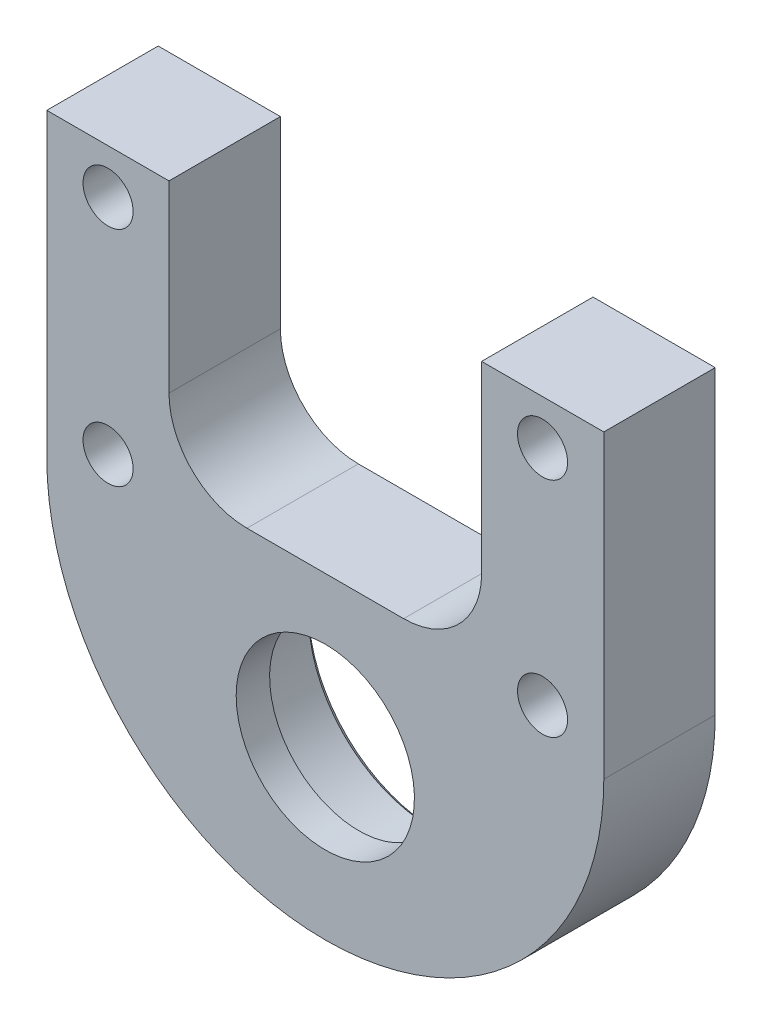
ISO-10303-21;
HEADER;
FILE_DESCRIPTION(('STEP AP214'),'2;1');
FILE_NAME('part.step','',(''),(''),'','','');
FILE_SCHEMA(('AUTOMOTIVE_DESIGN { 1 0 10303 214 1 1 1 1 }'));
ENDSEC;
DATA;
#1=APPLICATION_CONTEXT('core data for automotive mechanical design processes');
#2=APPLICATION_PROTOCOL_DEFINITION('international standard','automotive_design',2000,#1);
#3=PRODUCT_CONTEXT('',#1,'mechanical');
#4=PRODUCT('Part','Part','',(#3));
#5=PRODUCT_RELATED_PRODUCT_CATEGORY('part','',(#4));
#6=PRODUCT_DEFINITION_FORMATION('','',#4);
#7=PRODUCT_DEFINITION_CONTEXT('part definition',#1,'design');
#8=PRODUCT_DEFINITION('design','',#6,#7);
#9=PRODUCT_DEFINITION_SHAPE('','',#8);
#10=(LENGTH_UNIT() NAMED_UNIT(*) SI_UNIT(.MILLI.,.METRE.));
#11=(NAMED_UNIT(*) PLANE_ANGLE_UNIT() SI_UNIT($,.RADIAN.));
#12=(NAMED_UNIT(*) SI_UNIT($,.STERADIAN.) SOLID_ANGLE_UNIT());
#13=UNCERTAINTY_MEASURE_WITH_UNIT(LENGTH_MEASURE(1.E-05),#10,'distance_accuracy_value','');
#14=(GEOMETRIC_REPRESENTATION_CONTEXT(3) GLOBAL_UNCERTAINTY_ASSIGNED_CONTEXT((#13)) GLOBAL_UNIT_ASSIGNED_CONTEXT((#10,
#11,#12)) REPRESENTATION_CONTEXT('',''));
#15=CARTESIAN_POINT('',(0.,0.,0.));
#16=DIRECTION('',(0.,0.,1.));
#17=DIRECTION('',(1.,0.,0.));
#18=AXIS2_PLACEMENT_3D('',#15,#16,#17);
#19=CARTESIAN_POINT('',(-25.,37.,20.));
#20=DIRECTION('',(0.,-1.,0.));
#21=DIRECTION('',(1.,0.,0.));
#22=AXIS2_PLACEMENT_3D('',#19,#20,#21);
#23=PLANE('',#22);
#24=DIRECTION('',(-1.,0.,0.));
#25=VECTOR('',#24,1.);
#26=CARTESIAN_POINT('',(-25.,37.,10.));
#27=LINE('',#26,#25);
#28=CARTESIAN_POINT('',(-14.03125,37.,10.));
#29=VERTEX_POINT('',#28);
#30=CARTESIAN_POINT('',(-25.,37.,10.));
#31=VERTEX_POINT('',#30);
#32=EDGE_CURVE('E368',#29,#31,#27,.T.);
#33=ORIENTED_EDGE('',*,*,#32,.F.);
#34=DIRECTION('',(0.,0.,1.));
#35=VECTOR('',#34,1.);
#36=CARTESIAN_POINT('',(-14.03125,37.,0.));
#37=LINE('',#36,#35);
#38=CARTESIAN_POINT('',(-14.03125,37.,0.));
#39=VERTEX_POINT('',#38);
#40=EDGE_CURVE('E279',#39,#29,#37,.T.);
#41=ORIENTED_EDGE('',*,*,#40,.F.);
#42=DIRECTION('',(-1.,0.,0.));
#43=VECTOR('',#42,1.);
#44=CARTESIAN_POINT('',(-25.,37.,0.));
#45=LINE('',#44,#43);
#46=CARTESIAN_POINT('',(-25.,37.,0.));
#47=VERTEX_POINT('',#46);
#48=EDGE_CURVE('E259',#39,#47,#45,.T.);
#49=ORIENTED_EDGE('',*,*,#48,.T.);
#50=DIRECTION('',(0.,0.,-1.));
#51=VECTOR('',#50,1.);
#52=CARTESIAN_POINT('',(-25.,37.,20.));
#53=LINE('',#52,#51);
#54=EDGE_CURVE('E386',#31,#47,#53,.T.);
#55=ORIENTED_EDGE('',*,*,#54,.F.);
#56=EDGE_LOOP('',(#33,#41,#49,#55));
#57=FACE_BOUND('',#56,.T.);
#58=ADVANCED_FACE('F116',(#57),#23,.F.);
#59=CARTESIAN_POINT('',(0.,0.,0.));
#60=DIRECTION('',(0.,0.,-1.));
#61=DIRECTION('',(-1.,0.,0.));
#62=AXIS2_PLACEMENT_3D('',#59,#60,#61);
#63=PLANE('',#62);
#64=DIRECTION('',(0.,1.,0.));
#65=VECTOR('',#64,1.);
#66=CARTESIAN_POINT('',(25.,-15.,0.));
#67=LINE('',#66,#65);
#68=CARTESIAN_POINT('',(25.,10.,0.));
#69=VERTEX_POINT('',#68);
#70=CARTESIAN_POINT('',(25.,37.,0.));
#71=VERTEX_POINT('',#70);
#72=EDGE_CURVE('E381',#69,#71,#67,.T.);
#73=ORIENTED_EDGE('',*,*,#72,.F.);
#74=CARTESIAN_POINT('',(0.,10.,0.));
#75=DIRECTION('',(0.,0.,-1.));
#76=DIRECTION('',(-1.,0.,0.));
#77=AXIS2_PLACEMENT_3D('',#74,#75,#76);
#78=CIRCLE('',#77,25.);
#79=CARTESIAN_POINT('',(0.,-15.,0.));
#80=VERTEX_POINT('',#79);
#81=EDGE_CURVE('E405',#69,#80,#78,.T.);
#82=ORIENTED_EDGE('',*,*,#81,.T.);
#83=CARTESIAN_POINT('',(0.,10.,0.));
#84=DIRECTION('',(0.,0.,-1.));
#85=DIRECTION('',(-1.,0.,0.));
#86=AXIS2_PLACEMENT_3D('',#83,#84,#85);
#87=CIRCLE('',#86,25.);
#88=CARTESIAN_POINT('',(-25.,10.,0.));
#89=VERTEX_POINT('',#88);
#90=EDGE_CURVE('E403',#80,#89,#87,.T.);
#91=ORIENTED_EDGE('',*,*,#90,.T.);
#92=DIRECTION('',(0.,-1.,0.));
#93=VECTOR('',#92,1.);
#94=CARTESIAN_POINT('',(-25.,-15.,0.));
#95=LINE('',#94,#93);
#96=EDGE_CURVE('E379',#47,#89,#95,.T.);
#97=ORIENTED_EDGE('',*,*,#96,.F.);
#98=ORIENTED_EDGE('',*,*,#48,.F.);
#99=DIRECTION('',(0.,-1.,0.));
#100=VECTOR('',#99,1.);
#101=CARTESIAN_POINT('',(-14.03125,37.,0.));
#102=LINE('',#101,#100);
#103=CARTESIAN_POINT('',(-14.03125,20.5,0.));
#104=VERTEX_POINT('',#103);
#105=EDGE_CURVE('E236',#39,#104,#102,.T.);
#106=ORIENTED_EDGE('',*,*,#105,.T.);
#107=CARTESIAN_POINT('',(-7.03125000000002,20.5,0.));
#108=DIRECTION('',(0.,0.,1.));
#109=DIRECTION('',(1.,0.,0.));
#110=AXIS2_PLACEMENT_3D('',#107,#108,#109);
#111=CIRCLE('',#110,7.);
#112=CARTESIAN_POINT('',(-7.03125000000002,13.5,0.));
#113=VERTEX_POINT('',#112);
#114=EDGE_CURVE('E247',#104,#113,#111,.T.);
#115=ORIENTED_EDGE('',*,*,#114,.T.);
#116=DIRECTION('',(1.,0.,0.));
#117=VECTOR('',#116,1.);
#118=CARTESIAN_POINT('',(-7.03125000000002,13.5,0.));
#119=LINE('',#118,#117);
#120=CARTESIAN_POINT('',(7.03125000000002,13.5,0.));
#121=VERTEX_POINT('',#120);
#122=EDGE_CURVE('E252',#113,#121,#119,.T.);
#123=ORIENTED_EDGE('',*,*,#122,.T.);
#124=CARTESIAN_POINT('',(7.03125000000002,20.5,0.));
#125=DIRECTION('',(0.,0.,1.));
#126=DIRECTION('',(1.,0.,0.));
#127=AXIS2_PLACEMENT_3D('',#124,#125,#126);
#128=CIRCLE('',#127,7.);
#129=CARTESIAN_POINT('',(14.03125,20.5,0.));
#130=VERTEX_POINT('',#129);
#131=EDGE_CURVE('E266',#121,#130,#128,.T.);
#132=ORIENTED_EDGE('',*,*,#131,.T.);
#133=DIRECTION('',(0.,1.,0.));
#134=VECTOR('',#133,1.);
#135=CARTESIAN_POINT('',(14.03125,37.,0.));
#136=LINE('',#135,#134);
#137=CARTESIAN_POINT('',(14.03125,37.,0.));
#138=VERTEX_POINT('',#137);
#139=EDGE_CURVE('E244',#130,#138,#136,.T.);
#140=ORIENTED_EDGE('',*,*,#139,.T.);
#141=EDGE_CURVE('E383',#71,#138,#45,.T.);
#142=ORIENTED_EDGE('',*,*,#141,.F.);
#143=EDGE_LOOP('',(#73,#82,#91,#97,#98,#106,#115,#123,#132,#140,#142));
#144=FACE_BOUND('',#143,.T.);
#145=CARTESIAN_POINT('',(0.,0.,0.));
#146=DIRECTION('',(0.,0.,-1.));
#147=DIRECTION('',(-1.,0.,0.));
#148=AXIS2_PLACEMENT_3D('',#145,#146,#147);
#149=CIRCLE('',#148,11.5);
#150=CARTESIAN_POINT('',(-11.5,0.,0.));
#151=VERTEX_POINT('',#150);
#152=EDGE_CURVE('E397',#151,#151,#149,.F.);
#153=ORIENTED_EDGE('',*,*,#152,.T.);
#154=EDGE_LOOP('',(#153));
#155=FACE_BOUND('',#154,.T.);
#156=CARTESIAN_POINT('',(19.5,23.,0.));
#157=DIRECTION('',(0.,0.,-1.));
#158=DIRECTION('',(-1.,0.,0.));
#159=AXIS2_PLACEMENT_3D('',#156,#157,#158);
#160=CIRCLE('',#159,1.5875);
#161=CARTESIAN_POINT('',(17.9125,23.,0.));
#162=VERTEX_POINT('',#161);
#163=EDGE_CURVE('E334',#162,#162,#160,.T.);
#164=ORIENTED_EDGE('',*,*,#163,.F.);
#165=EDGE_LOOP('',(#164));
#166=FACE_BOUND('',#165,.T.);
#167=CARTESIAN_POINT('',(19.5,33.,0.));
#168=DIRECTION('',(0.,0.,1.));
#169=DIRECTION('',(1.,0.,0.));
#170=AXIS2_PLACEMENT_3D('',#167,#168,#169);
#171=CIRCLE('',#170,2.2479);
#172=CARTESIAN_POINT('',(21.7479,33.,0.));
#173=VERTEX_POINT('',#172);
#174=EDGE_CURVE('E343',#173,#173,#171,.T.);
#175=ORIENTED_EDGE('',*,*,#174,.T.);
#176=EDGE_LOOP('',(#175));
#177=FACE_BOUND('',#176,.T.);
#178=CARTESIAN_POINT('',(-19.5,33.,0.));
#179=DIRECTION('',(0.,0.,1.));
#180=DIRECTION('',(1.,0.,0.));
#181=AXIS2_PLACEMENT_3D('',#178,#179,#180);
#182=CIRCLE('',#181,2.2479);
#183=CARTESIAN_POINT('',(-17.2521,33.,0.));
#184=VERTEX_POINT('',#183);
#185=EDGE_CURVE('E349',#184,#184,#182,.T.);
#186=ORIENTED_EDGE('',*,*,#185,.T.);
#187=EDGE_LOOP('',(#186));
#188=FACE_BOUND('',#187,.T.);
#189=CARTESIAN_POINT('',(-19.5,13.,0.));
#190=DIRECTION('',(0.,0.,1.));
#191=DIRECTION('',(1.,0.,0.));
#192=AXIS2_PLACEMENT_3D('',#189,#190,#191);
#193=CIRCLE('',#192,2.2479);
#194=CARTESIAN_POINT('',(-17.2521,13.,0.));
#195=VERTEX_POINT('',#194);
#196=EDGE_CURVE('E355',#195,#195,#193,.T.);
#197=ORIENTED_EDGE('',*,*,#196,.T.);
#198=EDGE_LOOP('',(#197));
#199=FACE_BOUND('',#198,.T.);
#200=CARTESIAN_POINT('',(19.5,13.,0.));
#201=DIRECTION('',(0.,0.,1.));
#202=DIRECTION('',(1.,0.,0.));
#203=AXIS2_PLACEMENT_3D('',#200,#201,#202);
#204=CIRCLE('',#203,2.2479);
#205=CARTESIAN_POINT('',(21.7479,13.,0.));
#206=VERTEX_POINT('',#205);
#207=EDGE_CURVE('E361',#206,#206,#204,.T.);
#208=ORIENTED_EDGE('',*,*,#207,.T.);
#209=EDGE_LOOP('',(#208));
#210=FACE_BOUND('',#209,.T.);
#211=CARTESIAN_POINT('',(-19.0875,23.,0.));
#212=DIRECTION('',(0.,0.,-1.));
#213=DIRECTION('',(-1.,0.,0.));
#214=AXIS2_PLACEMENT_3D('',#211,#212,#213);
#215=CIRCLE('',#214,1.5875);
#216=CARTESIAN_POINT('',(-19.0875,24.5875,0.));
#217=VERTEX_POINT('',#216);
#218=CARTESIAN_POINT('',(-19.0875,21.4125,0.));
#219=VERTEX_POINT('',#218);
#220=EDGE_CURVE('E307',#217,#219,#215,.T.);
#221=ORIENTED_EDGE('',*,*,#220,.F.);
#222=DIRECTION('',(-1.,0.,0.));
#223=VECTOR('',#222,1.);
#224=CARTESIAN_POINT('',(-19.0875,24.5875,0.));
#225=LINE('',#224,#223);
#226=CARTESIAN_POINT('',(-19.9125,24.5875,0.));
#227=VERTEX_POINT('',#226);
#228=EDGE_CURVE('E298',#217,#227,#225,.T.);
#229=ORIENTED_EDGE('',*,*,#228,.T.);
#230=CARTESIAN_POINT('',(-19.9125,23.,0.));
#231=DIRECTION('',(0.,0.,-1.));
#232=DIRECTION('',(-1.,0.,0.));
#233=AXIS2_PLACEMENT_3D('',#230,#231,#232);
#234=CIRCLE('',#233,1.5875);
#235=CARTESIAN_POINT('',(-19.9125,21.4125,0.));
#236=VERTEX_POINT('',#235);
#237=EDGE_CURVE('E323',#236,#227,#234,.T.);
#238=ORIENTED_EDGE('',*,*,#237,.F.);
#239=DIRECTION('',(-1.,0.,0.));
#240=VECTOR('',#239,1.);
#241=CARTESIAN_POINT('',(-19.0875,21.4125,0.));
#242=LINE('',#241,#240);
#243=EDGE_CURVE('E281',#219,#236,#242,.T.);
#244=ORIENTED_EDGE('',*,*,#243,.F.);
#245=EDGE_LOOP('',(#221,#229,#238,#244));
#246=FACE_BOUND('',#245,.T.);
#247=ADVANCED_FACE('F256',(#144,#155,#166,#177,#188,#199,#210,#246),#63,.T.);
#248=CARTESIAN_POINT('',(25.,-15.,20.));
#249=DIRECTION('',(-1.,0.,0.));
#250=DIRECTION('',(0.,-1.,0.));
#251=AXIS2_PLACEMENT_3D('',#248,#249,#250);
#252=PLANE('',#251);
#253=DIRECTION('',(0.,1.,0.));
#254=VECTOR('',#253,1.);
#255=CARTESIAN_POINT('',(25.,-15.,10.));
#256=LINE('',#255,#254);
#257=CARTESIAN_POINT('',(25.,10.,10.));
#258=VERTEX_POINT('',#257);
#259=CARTESIAN_POINT('',(25.,37.,10.));
#260=VERTEX_POINT('',#259);
#261=EDGE_CURVE('E366',#258,#260,#256,.T.);
#262=ORIENTED_EDGE('',*,*,#261,.F.);
#263=DIRECTION('',(0.,0.,-1.));
#264=VECTOR('',#263,1.);
#265=CARTESIAN_POINT('',(25.,10.,20.));
#266=LINE('',#265,#264);
#267=EDGE_CURVE('E400',#258,#69,#266,.T.);
#268=ORIENTED_EDGE('',*,*,#267,.T.);
#269=ORIENTED_EDGE('',*,*,#72,.T.);
#270=DIRECTION('',(0.,0.,-1.));
#271=VECTOR('',#270,1.);
#272=CARTESIAN_POINT('',(25.,37.,20.));
#273=LINE('',#272,#271);
#274=EDGE_CURVE('E389',#260,#71,#273,.T.);
#275=ORIENTED_EDGE('',*,*,#274,.F.);
#276=EDGE_LOOP('',(#262,#268,#269,#275));
#277=FACE_BOUND('',#276,.T.);
#278=ADVANCED_FACE('F418',(#277),#252,.F.);
#279=CARTESIAN_POINT('',(-25.,-15.,20.));
#280=DIRECTION('',(1.,0.,0.));
#281=DIRECTION('',(0.,0.,-1.));
#282=AXIS2_PLACEMENT_3D('',#279,#280,#281);
#283=PLANE('',#282);
#284=ORIENTED_EDGE('',*,*,#96,.T.);
#285=DIRECTION('',(0.,0.,-1.));
#286=VECTOR('',#285,1.);
#287=CARTESIAN_POINT('',(-25.,10.,20.));
#288=LINE('',#287,#286);
#289=CARTESIAN_POINT('',(-25.,10.,10.));
#290=VERTEX_POINT('',#289);
#291=EDGE_CURVE('E14',#89,#290,#288,.F.);
#292=ORIENTED_EDGE('',*,*,#291,.T.);
#293=DIRECTION('',(0.,-1.,0.));
#294=VECTOR('',#293,1.);
#295=CARTESIAN_POINT('',(-25.,-15.,10.));
#296=LINE('',#295,#294);
#297=EDGE_CURVE('E364',#31,#290,#296,.T.);
#298=ORIENTED_EDGE('',*,*,#297,.F.);
#299=ORIENTED_EDGE('',*,*,#54,.T.);
#300=EDGE_LOOP('',(#284,#292,#298,#299));
#301=FACE_BOUND('',#300,.T.);
#302=ADVANCED_FACE('F442',(#301),#283,.F.);
#303=ORIENTED_EDGE('',*,*,#141,.T.);
#304=DIRECTION('',(0.,0.,1.));
#305=VECTOR('',#304,1.);
#306=CARTESIAN_POINT('',(14.03125,37.,0.));
#307=LINE('',#306,#305);
#308=CARTESIAN_POINT('',(14.03125,37.,10.));
#309=VERTEX_POINT('',#308);
#310=EDGE_CURVE('E282',#138,#309,#307,.T.);
#311=ORIENTED_EDGE('',*,*,#310,.T.);
#312=EDGE_CURVE('E369',#260,#309,#27,.T.);
#313=ORIENTED_EDGE('',*,*,#312,.F.);
#314=ORIENTED_EDGE('',*,*,#274,.T.);
#315=EDGE_LOOP('',(#303,#311,#313,#314));
#316=FACE_BOUND('',#315,.T.);
#317=ADVANCED_FACE('F433',(#316),#23,.F.);
#318=CARTESIAN_POINT('',(0.,0.,0.));
#319=DIRECTION('',(0.,0.,-1.));
#320=DIRECTION('',(0.,1.,0.));
#321=AXIS2_PLACEMENT_3D('',#318,#319,#320);
#322=CYLINDRICAL_SURFACE('',#321,8.);
#323=CARTESIAN_POINT('',(0.,0.,10.));
#324=DIRECTION('',(0.,0.,-1.));
#325=DIRECTION('',(-1.,0.,0.));
#326=AXIS2_PLACEMENT_3D('',#323,#324,#325);
#327=CIRCLE('',#326,8.);
#328=CARTESIAN_POINT('',(-8.,0.,10.));
#329=VERTEX_POINT('',#328);
#330=EDGE_CURVE('E372',#329,#329,#327,.F.);
#331=ORIENTED_EDGE('',*,*,#330,.T.);
#332=EDGE_LOOP('',(#331));
#333=FACE_BOUND('',#332,.T.);
#334=CARTESIAN_POINT('',(0.,0.,7.));
#335=DIRECTION('',(0.,0.,-1.));
#336=DIRECTION('',(0.,1.,0.));
#337=AXIS2_PLACEMENT_3D('',#334,#335,#336);
#338=CIRCLE('',#337,8.);
#339=CARTESIAN_POINT('',(0.,8.,7.));
#340=VERTEX_POINT('',#339);
#341=EDGE_CURVE('E376',#340,#340,#338,.T.);
#342=ORIENTED_EDGE('',*,*,#341,.T.);
#343=EDGE_LOOP('',(#342));
#344=FACE_BOUND('',#343,.T.);
#345=ADVANCED_FACE('F441',(#333,#344),#322,.F.);
#346=CARTESIAN_POINT('',(0.,8.,7.));
#347=DIRECTION('',(0.,0.,1.));
#348=DIRECTION('',(0.,-1.,0.));
#349=AXIS2_PLACEMENT_3D('',#346,#347,#348);
#350=PLANE('',#349);
#351=ORIENTED_EDGE('',*,*,#341,.F.);
#352=EDGE_LOOP('',(#351));
#353=FACE_BOUND('',#352,.T.);
#354=CARTESIAN_POINT('',(0.,0.,7.));
#355=DIRECTION('',(0.,0.,-1.));
#356=DIRECTION('',(0.,1.,0.));
#357=AXIS2_PLACEMENT_3D('',#354,#355,#356);
#358=CIRCLE('',#357,11.);
#359=CARTESIAN_POINT('',(0.,11.,7.));
#360=VERTEX_POINT('',#359);
#361=EDGE_CURVE('E373',#360,#360,#358,.T.);
#362=ORIENTED_EDGE('',*,*,#361,.T.);
#363=EDGE_LOOP('',(#362));
#364=FACE_BOUND('',#363,.T.);
#365=ADVANCED_FACE('F448',(#353,#364),#350,.F.);
#366=CARTESIAN_POINT('',(0.,0.,0.));
#367=DIRECTION('',(0.,0.,-1.));
#368=DIRECTION('',(0.,1.,0.));
#369=AXIS2_PLACEMENT_3D('',#366,#367,#368);
#370=CYLINDRICAL_SURFACE('',#369,11.);
#371=CARTESIAN_POINT('',(0.,0.,0.499999999999992));
#372=DIRECTION('',(0.,0.,-1.));
#373=DIRECTION('',(0.,1.,0.));
#374=AXIS2_PLACEMENT_3D('',#371,#372,#373);
#375=CIRCLE('',#374,11.);
#376=CARTESIAN_POINT('',(0.,11.,0.499999999999993));
#377=VERTEX_POINT('',#376);
#378=EDGE_CURVE('E392',#377,#377,#375,.T.);
#379=ORIENTED_EDGE('',*,*,#378,.T.);
#380=EDGE_LOOP('',(#379));
#381=FACE_BOUND('',#380,.T.);
#382=ORIENTED_EDGE('',*,*,#361,.F.);
#383=EDGE_LOOP('',(#382));
#384=FACE_BOUND('',#383,.T.);
#385=ADVANCED_FACE('F532',(#381,#384),#370,.F.);
#386=CARTESIAN_POINT('',(0.,0.,10.));
#387=DIRECTION('',(0.,0.,-1.));
#388=DIRECTION('',(-1.,0.,0.));
#389=AXIS2_PLACEMENT_3D('',#386,#387,#388);
#390=PLANE('',#389);
#391=CARTESIAN_POINT('',(19.5,33.,10.));
#392=DIRECTION('',(0.,0.,1.));
#393=DIRECTION('',(1.,0.,0.));
#394=AXIS2_PLACEMENT_3D('',#391,#392,#393);
#395=CIRCLE('',#394,2.2479);
#396=CARTESIAN_POINT('',(21.7479,33.,10.));
#397=VERTEX_POINT('',#396);
#398=EDGE_CURVE('E340',#397,#397,#395,.T.);
#399=ORIENTED_EDGE('',*,*,#398,.F.);
#400=EDGE_LOOP('',(#399));
#401=FACE_BOUND('',#400,.T.);
#402=CARTESIAN_POINT('',(-19.5,33.,10.));
#403=DIRECTION('',(0.,0.,1.));
#404=DIRECTION('',(1.,0.,0.));
#405=AXIS2_PLACEMENT_3D('',#402,#403,#404);
#406=CIRCLE('',#405,2.2479);
#407=CARTESIAN_POINT('',(-17.2521,33.,10.));
#408=VERTEX_POINT('',#407);
#409=EDGE_CURVE('E346',#408,#408,#406,.T.);
#410=ORIENTED_EDGE('',*,*,#409,.F.);
#411=EDGE_LOOP('',(#410));
#412=FACE_BOUND('',#411,.T.);
#413=CARTESIAN_POINT('',(-19.5,13.,10.));
#414=DIRECTION('',(0.,0.,1.));
#415=DIRECTION('',(1.,0.,0.));
#416=AXIS2_PLACEMENT_3D('',#413,#414,#415);
#417=CIRCLE('',#416,2.2479);
#418=CARTESIAN_POINT('',(-17.2521,13.,10.));
#419=VERTEX_POINT('',#418);
#420=EDGE_CURVE('E352',#419,#419,#417,.T.);
#421=ORIENTED_EDGE('',*,*,#420,.F.);
#422=EDGE_LOOP('',(#421));
#423=FACE_BOUND('',#422,.T.);
#424=CARTESIAN_POINT('',(19.5,13.,10.));
#425=DIRECTION('',(0.,0.,1.));
#426=DIRECTION('',(1.,0.,0.));
#427=AXIS2_PLACEMENT_3D('',#424,#425,#426);
#428=CIRCLE('',#427,2.2479);
#429=CARTESIAN_POINT('',(21.7479,13.,10.));
#430=VERTEX_POINT('',#429);
#431=EDGE_CURVE('E358',#430,#430,#428,.T.);
#432=ORIENTED_EDGE('',*,*,#431,.F.);
#433=EDGE_LOOP('',(#432));
#434=FACE_BOUND('',#433,.T.);
#435=CARTESIAN_POINT('',(0.,10.,10.));
#436=DIRECTION('',(0.,0.,-1.));
#437=DIRECTION('',(-1.,0.,0.));
#438=AXIS2_PLACEMENT_3D('',#435,#436,#437);
#439=CIRCLE('',#438,25.);
#440=CARTESIAN_POINT('',(0.,-15.,10.));
#441=VERTEX_POINT('',#440);
#442=EDGE_CURVE('E132',#290,#441,#439,.F.);
#443=ORIENTED_EDGE('',*,*,#442,.T.);
#444=CARTESIAN_POINT('',(0.,10.,10.));
#445=DIRECTION('',(0.,0.,-1.));
#446=DIRECTION('',(-1.,0.,0.));
#447=AXIS2_PLACEMENT_3D('',#444,#445,#446);
#448=CIRCLE('',#447,25.);
#449=EDGE_CURVE('E125',#441,#258,#448,.F.);
#450=ORIENTED_EDGE('',*,*,#449,.T.);
#451=ORIENTED_EDGE('',*,*,#261,.T.);
#452=ORIENTED_EDGE('',*,*,#312,.T.);
#453=DIRECTION('',(0.,1.,0.));
#454=VECTOR('',#453,1.);
#455=CARTESIAN_POINT('',(14.03125,37.,10.));
#456=LINE('',#455,#454);
#457=CARTESIAN_POINT('',(14.03125,20.5,10.));
#458=VERTEX_POINT('',#457);
#459=EDGE_CURVE('E260',#458,#309,#456,.T.);
#460=ORIENTED_EDGE('',*,*,#459,.F.);
#461=CARTESIAN_POINT('',(7.03125000000002,20.5,10.));
#462=DIRECTION('',(0.,0.,1.));
#463=DIRECTION('',(1.,0.,0.));
#464=AXIS2_PLACEMENT_3D('',#461,#462,#463);
#465=CIRCLE('',#464,7.);
#466=CARTESIAN_POINT('',(7.03125000000002,13.5,10.));
#467=VERTEX_POINT('',#466);
#468=EDGE_CURVE('E262',#467,#458,#465,.T.);
#469=ORIENTED_EDGE('',*,*,#468,.F.);
#470=DIRECTION('',(1.,0.,0.));
#471=VECTOR('',#470,1.);
#472=CARTESIAN_POINT('',(-7.03125000000002,13.5,10.));
#473=LINE('',#472,#471);
#474=CARTESIAN_POINT('',(-7.03125000000002,13.5,10.));
#475=VERTEX_POINT('',#474);
#476=EDGE_CURVE('E274',#475,#467,#473,.T.);
#477=ORIENTED_EDGE('',*,*,#476,.F.);
#478=CARTESIAN_POINT('',(-7.03125000000002,20.5,10.));
#479=DIRECTION('',(0.,0.,1.));
#480=DIRECTION('',(1.,0.,0.));
#481=AXIS2_PLACEMENT_3D('',#478,#479,#480);
#482=CIRCLE('',#481,7.);
#483=CARTESIAN_POINT('',(-14.03125,20.5,10.));
#484=VERTEX_POINT('',#483);
#485=EDGE_CURVE('E272',#484,#475,#482,.T.);
#486=ORIENTED_EDGE('',*,*,#485,.F.);
#487=DIRECTION('',(0.,-1.,0.));
#488=VECTOR('',#487,1.);
#489=CARTESIAN_POINT('',(-14.03125,37.,10.));
#490=LINE('',#489,#488);
#491=EDGE_CURVE('E239',#29,#484,#490,.T.);
#492=ORIENTED_EDGE('',*,*,#491,.F.);
#493=ORIENTED_EDGE('',*,*,#32,.T.);
#494=ORIENTED_EDGE('',*,*,#297,.T.);
#495=EDGE_LOOP('',(#443,#450,#451,#452,#460,#469,#477,#486,#492,#493,#494));
#496=FACE_BOUND('',#495,.T.);
#497=ORIENTED_EDGE('',*,*,#330,.F.);
#498=EDGE_LOOP('',(#497));
#499=FACE_BOUND('',#498,.T.);
#500=ADVANCED_FACE('F410',(#401,#412,#423,#434,#496,#499),#390,.F.);
#501=CARTESIAN_POINT('',(19.5,13.,10.));
#502=DIRECTION('',(0.,0.,1.));
#503=DIRECTION('',(1.,0.,0.));
#504=AXIS2_PLACEMENT_3D('',#501,#502,#503);
#505=CYLINDRICAL_SURFACE('',#504,2.2479);
#506=ORIENTED_EDGE('',*,*,#207,.F.);
#507=EDGE_LOOP('',(#506));
#508=FACE_BOUND('',#507,.T.);
#509=ORIENTED_EDGE('',*,*,#431,.T.);
#510=EDGE_LOOP('',(#509));
#511=FACE_BOUND('',#510,.T.);
#512=ADVANCED_FACE('F525',(#508,#511),#505,.F.);
#513=CARTESIAN_POINT('',(-19.5,13.,10.));
#514=DIRECTION('',(0.,0.,1.));
#515=DIRECTION('',(1.,0.,0.));
#516=AXIS2_PLACEMENT_3D('',#513,#514,#515);
#517=CYLINDRICAL_SURFACE('',#516,2.2479);
#518=ORIENTED_EDGE('',*,*,#196,.F.);
#519=EDGE_LOOP('',(#518));
#520=FACE_BOUND('',#519,.T.);
#521=ORIENTED_EDGE('',*,*,#420,.T.);
#522=EDGE_LOOP('',(#521));
#523=FACE_BOUND('',#522,.T.);
#524=ADVANCED_FACE('F521',(#520,#523),#517,.F.);
#525=CARTESIAN_POINT('',(-19.5,33.,10.));
#526=DIRECTION('',(0.,0.,1.));
#527=DIRECTION('',(1.,0.,0.));
#528=AXIS2_PLACEMENT_3D('',#525,#526,#527);
#529=CYLINDRICAL_SURFACE('',#528,2.2479);
#530=ORIENTED_EDGE('',*,*,#185,.F.);
#531=EDGE_LOOP('',(#530));
#532=FACE_BOUND('',#531,.T.);
#533=ORIENTED_EDGE('',*,*,#409,.T.);
#534=EDGE_LOOP('',(#533));
#535=FACE_BOUND('',#534,.T.);
#536=ADVANCED_FACE('F517',(#532,#535),#529,.F.);
#537=CARTESIAN_POINT('',(19.5,33.,10.));
#538=DIRECTION('',(0.,0.,1.));
#539=DIRECTION('',(1.,0.,0.));
#540=AXIS2_PLACEMENT_3D('',#537,#538,#539);
#541=CYLINDRICAL_SURFACE('',#540,2.2479);
#542=ORIENTED_EDGE('',*,*,#174,.F.);
#543=EDGE_LOOP('',(#542));
#544=FACE_BOUND('',#543,.T.);
#545=ORIENTED_EDGE('',*,*,#398,.T.);
#546=EDGE_LOOP('',(#545));
#547=FACE_BOUND('',#546,.T.);
#548=ADVANCED_FACE('F513',(#544,#547),#541,.F.);
#549=CARTESIAN_POINT('',(19.5,23.,5.));
#550=DIRECTION('',(0.,0.,-1.));
#551=DIRECTION('',(-1.,0.,0.));
#552=AXIS2_PLACEMENT_3D('',#549,#550,#551);
#553=CONICAL_SURFACE('',#552,1.5875,1.02974425867665);
#554=CARTESIAN_POINT('',(19.5,23.,5.95386623270625));
#555=VERTEX_POINT('',#554);
#556=VERTEX_LOOP('',#555);
#557=FACE_BOUND('',#556,.T.);
#558=CARTESIAN_POINT('',(19.5,23.,5.));
#559=DIRECTION('',(0.,0.,-1.));
#560=DIRECTION('',(-1.,0.,0.));
#561=AXIS2_PLACEMENT_3D('',#558,#559,#560);
#562=CIRCLE('',#561,1.5875);
#563=CARTESIAN_POINT('',(17.9125,23.,5.));
#564=VERTEX_POINT('',#563);
#565=EDGE_CURVE('E337',#564,#564,#562,.T.);
#566=ORIENTED_EDGE('',*,*,#565,.T.);
#567=EDGE_LOOP('',(#566));
#568=FACE_BOUND('',#567,.T.);
#569=ADVANCED_FACE('F509',(#557,#568),#553,.F.);
#570=CARTESIAN_POINT('',(19.5,23.,0.));
#571=DIRECTION('',(0.,0.,-1.));
#572=DIRECTION('',(-1.,0.,0.));
#573=AXIS2_PLACEMENT_3D('',#570,#571,#572);
#574=CYLINDRICAL_SURFACE('',#573,1.5875);
#575=ORIENTED_EDGE('',*,*,#565,.F.);
#576=EDGE_LOOP('',(#575));
#577=FACE_BOUND('',#576,.T.);
#578=ORIENTED_EDGE('',*,*,#163,.T.);
#579=EDGE_LOOP('',(#578));
#580=FACE_BOUND('',#579,.T.);
#581=ADVANCED_FACE('F505',(#577,#580),#574,.F.);
#582=CARTESIAN_POINT('',(-19.9125,23.,5.));
#583=DIRECTION('',(0.,0.,-1.));
#584=DIRECTION('',(-1.,0.,0.));
#585=AXIS2_PLACEMENT_3D('',#582,#583,#584);
#586=CONICAL_SURFACE('',#585,1.5875,1.02974425867665);
#587=CARTESIAN_POINT('',(-19.9125,23.,5.));
#588=DIRECTION('',(0.,0.,-1.));
#589=DIRECTION('',(-1.,0.,0.));
#590=AXIS2_PLACEMENT_3D('',#587,#588,#589);
#591=CIRCLE('',#590,1.5875);
#592=CARTESIAN_POINT('',(-19.9125,21.4125,5.));
#593=VERTEX_POINT('',#592);
#594=CARTESIAN_POINT('',(-19.9125,24.5875,5.));
#595=VERTEX_POINT('',#594);
#596=EDGE_CURVE('E326',#593,#595,#591,.T.);
#597=ORIENTED_EDGE('',*,*,#596,.T.);
#598=DIRECTION('',(0.,-0.857167300702112,0.515038074910054));
#599=VECTOR('',#598,1.);
#600=CARTESIAN_POINT('',(-19.9125,23.,5.95386623270625));
#601=LINE('',#600,#599);
#602=CARTESIAN_POINT('',(-19.9125,23.,5.95386623270625));
#603=VERTEX_POINT('',#602);
#604=EDGE_CURVE('E317',#603,#595,#601,.F.);
#605=ORIENTED_EDGE('',*,*,#604,.F.);
#606=DIRECTION('',(0.,-0.857167300702112,-0.515038074910054));
#607=VECTOR('',#606,1.);
#608=CARTESIAN_POINT('',(-19.9125,23.,5.95386623270625));
#609=LINE('',#608,#607);
#610=EDGE_CURVE('E320',#593,#603,#609,.F.);
#611=ORIENTED_EDGE('',*,*,#610,.F.);
#612=EDGE_LOOP('',(#597,#605,#611));
#613=FACE_BOUND('',#612,.T.);
#614=ADVANCED_FACE('F501',(#613),#586,.F.);
#615=CARTESIAN_POINT('',(-19.9125,23.,0.));
#616=DIRECTION('',(0.,0.,-1.));
#617=DIRECTION('',(-1.,0.,0.));
#618=AXIS2_PLACEMENT_3D('',#615,#616,#617);
#619=CYLINDRICAL_SURFACE('',#618,1.5875);
#620=ORIENTED_EDGE('',*,*,#237,.T.);
#621=DIRECTION('',(0.,0.,-1.));
#622=VECTOR('',#621,1.);
#623=CARTESIAN_POINT('',(-19.9125,24.5875,0.));
#624=LINE('',#623,#622);
#625=EDGE_CURVE('E329',#595,#227,#624,.T.);
#626=ORIENTED_EDGE('',*,*,#625,.F.);
#627=ORIENTED_EDGE('',*,*,#596,.F.);
#628=DIRECTION('',(0.,0.,-1.));
#629=VECTOR('',#628,1.);
#630=CARTESIAN_POINT('',(-19.9125,21.4125,0.));
#631=LINE('',#630,#629);
#632=EDGE_CURVE('E331',#236,#593,#631,.F.);
#633=ORIENTED_EDGE('',*,*,#632,.F.);
#634=EDGE_LOOP('',(#620,#626,#627,#633));
#635=FACE_BOUND('',#634,.T.);
#636=ADVANCED_FACE('F497',(#635),#619,.F.);
#637=CARTESIAN_POINT('',(-19.0875,23.,5.));
#638=DIRECTION('',(0.,0.,-1.));
#639=DIRECTION('',(-1.,0.,0.));
#640=AXIS2_PLACEMENT_3D('',#637,#638,#639);
#641=CONICAL_SURFACE('',#640,1.5875,1.02974425867665);
#642=CARTESIAN_POINT('',(-19.0875,23.,5.));
#643=DIRECTION('',(0.,0.,-1.));
#644=DIRECTION('',(-1.,0.,0.));
#645=AXIS2_PLACEMENT_3D('',#642,#643,#644);
#646=CIRCLE('',#645,1.5875);
#647=CARTESIAN_POINT('',(-19.0875,24.5875,5.));
#648=VERTEX_POINT('',#647);
#649=CARTESIAN_POINT('',(-19.0875,21.4125,5.));
#650=VERTEX_POINT('',#649);
#651=EDGE_CURVE('E309',#648,#650,#646,.T.);
#652=ORIENTED_EDGE('',*,*,#651,.T.);
#653=DIRECTION('',(0.,0.857167300702112,0.515038074910054));
#654=VECTOR('',#653,1.);
#655=CARTESIAN_POINT('',(-19.0875,23.,5.95386623270625));
#656=LINE('',#655,#654);
#657=CARTESIAN_POINT('',(-19.0875,23.,5.95386623270625));
#658=VERTEX_POINT('',#657);
#659=EDGE_CURVE('E301',#658,#650,#656,.F.);
#660=ORIENTED_EDGE('',*,*,#659,.F.);
#661=DIRECTION('',(0.,0.857167300702112,-0.515038074910054));
#662=VECTOR('',#661,1.);
#663=CARTESIAN_POINT('',(-19.0875,23.,5.95386623270625));
#664=LINE('',#663,#662);
#665=EDGE_CURVE('E304',#648,#658,#664,.F.);
#666=ORIENTED_EDGE('',*,*,#665,.F.);
#667=EDGE_LOOP('',(#652,#660,#666));
#668=FACE_BOUND('',#667,.T.);
#669=ADVANCED_FACE('F493',(#668),#641,.F.);
#670=CARTESIAN_POINT('',(-19.0875,23.,0.));
#671=DIRECTION('',(0.,0.,-1.));
#672=DIRECTION('',(-1.,0.,0.));
#673=AXIS2_PLACEMENT_3D('',#670,#671,#672);
#674=CYLINDRICAL_SURFACE('',#673,1.5875);
#675=ORIENTED_EDGE('',*,*,#220,.T.);
#676=DIRECTION('',(0.,0.,-1.));
#677=VECTOR('',#676,1.);
#678=CARTESIAN_POINT('',(-19.0875,21.4125,0.));
#679=LINE('',#678,#677);
#680=EDGE_CURVE('E311',#650,#219,#679,.T.);
#681=ORIENTED_EDGE('',*,*,#680,.F.);
#682=ORIENTED_EDGE('',*,*,#651,.F.);
#683=DIRECTION('',(0.,0.,-1.));
#684=VECTOR('',#683,1.);
#685=CARTESIAN_POINT('',(-19.0875,24.5875,0.));
#686=LINE('',#685,#684);
#687=EDGE_CURVE('E314',#217,#648,#686,.F.);
#688=ORIENTED_EDGE('',*,*,#687,.F.);
#689=EDGE_LOOP('',(#675,#681,#682,#688));
#690=FACE_BOUND('',#689,.T.);
#691=ADVANCED_FACE('F489',(#690),#674,.F.);
#692=CARTESIAN_POINT('',(-19.0875,24.5875,0.));
#693=DIRECTION('',(0.,1.,0.));
#694=DIRECTION('',(0.,0.,1.));
#695=AXIS2_PLACEMENT_3D('',#692,#693,#694);
#696=PLANE('',#695);
#697=ORIENTED_EDGE('',*,*,#625,.T.);
#698=ORIENTED_EDGE('',*,*,#228,.F.);
#699=ORIENTED_EDGE('',*,*,#687,.T.);
#700=DIRECTION('',(-1.,0.,0.));
#701=VECTOR('',#700,1.);
#702=CARTESIAN_POINT('',(-19.0875,24.5875,5.));
#703=LINE('',#702,#701);
#704=EDGE_CURVE('E296',#648,#595,#703,.T.);
#705=ORIENTED_EDGE('',*,*,#704,.T.);
#706=EDGE_LOOP('',(#697,#698,#699,#705));
#707=FACE_BOUND('',#706,.T.);
#708=ADVANCED_FACE('F485',(#707),#696,.F.);
#709=CARTESIAN_POINT('',(-19.0875,23.,5.95386623270625));
#710=DIRECTION('',(0.,0.515038074910055,0.857167300702112));
#711=DIRECTION('',(0.,-0.857167300702112,0.515038074910055));
#712=AXIS2_PLACEMENT_3D('',#709,#710,#711);
#713=PLANE('',#712);
#714=ORIENTED_EDGE('',*,*,#604,.T.);
#715=ORIENTED_EDGE('',*,*,#704,.F.);
#716=ORIENTED_EDGE('',*,*,#665,.T.);
#717=DIRECTION('',(-1.,0.,0.));
#718=VECTOR('',#717,1.);
#719=CARTESIAN_POINT('',(-19.0875,23.,5.95386623270625));
#720=LINE('',#719,#718);
#721=EDGE_CURVE('E294',#658,#603,#720,.T.);
#722=ORIENTED_EDGE('',*,*,#721,.T.);
#723=EDGE_LOOP('',(#714,#715,#716,#722));
#724=FACE_BOUND('',#723,.T.);
#725=ADVANCED_FACE('F481',(#724),#713,.F.);
#726=CARTESIAN_POINT('',(-19.0875,23.,5.95386623270625));
#727=DIRECTION('',(0.,-0.515038074910055,0.857167300702112));
#728=DIRECTION('',(0.,-0.857167300702112,-0.515038074910055));
#729=AXIS2_PLACEMENT_3D('',#726,#727,#728);
#730=PLANE('',#729);
#731=ORIENTED_EDGE('',*,*,#610,.T.);
#732=ORIENTED_EDGE('',*,*,#721,.F.);
#733=ORIENTED_EDGE('',*,*,#659,.T.);
#734=DIRECTION('',(-1.,0.,0.));
#735=VECTOR('',#734,1.);
#736=CARTESIAN_POINT('',(-19.0875,21.4125,5.));
#737=LINE('',#736,#735);
#738=EDGE_CURVE('E291',#650,#593,#737,.T.);
#739=ORIENTED_EDGE('',*,*,#738,.T.);
#740=EDGE_LOOP('',(#731,#732,#733,#739));
#741=FACE_BOUND('',#740,.T.);
#742=ADVANCED_FACE('F477',(#741),#730,.F.);
#743=CARTESIAN_POINT('',(-19.0875,21.4125,0.));
#744=DIRECTION('',(0.,-1.,0.));
#745=DIRECTION('',(0.,0.,-1.));
#746=AXIS2_PLACEMENT_3D('',#743,#744,#745);
#747=PLANE('',#746);
#748=ORIENTED_EDGE('',*,*,#632,.T.);
#749=ORIENTED_EDGE('',*,*,#738,.F.);
#750=ORIENTED_EDGE('',*,*,#680,.T.);
#751=ORIENTED_EDGE('',*,*,#243,.T.);
#752=EDGE_LOOP('',(#748,#749,#750,#751));
#753=FACE_BOUND('',#752,.T.);
#754=ADVANCED_FACE('F474',(#753),#747,.F.);
#755=CARTESIAN_POINT('',(0.,0.,0.499999999999992));
#756=DIRECTION('',(0.,0.,-1.));
#757=DIRECTION('',(0.,1.,0.));
#758=AXIS2_PLACEMENT_3D('',#755,#756,#757);
#759=CONICAL_SURFACE('',#758,11.,0.785398163397452);
#760=ORIENTED_EDGE('',*,*,#152,.F.);
#761=EDGE_LOOP('',(#760));
#762=FACE_BOUND('',#761,.T.);
#763=ORIENTED_EDGE('',*,*,#378,.F.);
#764=EDGE_LOOP('',(#763));
#765=FACE_BOUND('',#764,.T.);
#766=ADVANCED_FACE('F473',(#762,#765),#759,.F.);
#767=CARTESIAN_POINT('',(-14.03125,37.,0.));
#768=DIRECTION('',(-1.,0.,0.));
#769=DIRECTION('',(0.,-1.,0.));
#770=AXIS2_PLACEMENT_3D('',#767,#768,#769);
#771=PLANE('',#770);
#772=ORIENTED_EDGE('',*,*,#491,.T.);
#773=DIRECTION('',(0.,0.,1.));
#774=VECTOR('',#773,1.);
#775=CARTESIAN_POINT('',(-14.03125,20.5,0.));
#776=LINE('',#775,#774);
#777=EDGE_CURVE('E232',#104,#484,#776,.T.);
#778=ORIENTED_EDGE('',*,*,#777,.F.);
#779=ORIENTED_EDGE('',*,*,#105,.F.);
#780=ORIENTED_EDGE('',*,*,#40,.T.);
#781=EDGE_LOOP('',(#772,#778,#779,#780));
#782=FACE_BOUND('',#781,.T.);
#783=ADVANCED_FACE('F234',(#782),#771,.F.);
#784=CARTESIAN_POINT('',(14.03125,37.,0.));
#785=DIRECTION('',(1.,0.,0.));
#786=DIRECTION('',(0.,0.,-1.));
#787=AXIS2_PLACEMENT_3D('',#784,#785,#786);
#788=PLANE('',#787);
#789=ORIENTED_EDGE('',*,*,#459,.T.);
#790=ORIENTED_EDGE('',*,*,#310,.F.);
#791=ORIENTED_EDGE('',*,*,#139,.F.);
#792=DIRECTION('',(0.,0.,1.));
#793=VECTOR('',#792,1.);
#794=CARTESIAN_POINT('',(14.03125,20.5,0.));
#795=LINE('',#794,#793);
#796=EDGE_CURVE('E285',#130,#458,#795,.T.);
#797=ORIENTED_EDGE('',*,*,#796,.T.);
#798=EDGE_LOOP('',(#789,#790,#791,#797));
#799=FACE_BOUND('',#798,.T.);
#800=ADVANCED_FACE('F455',(#799),#788,.F.);
#801=CARTESIAN_POINT('',(7.03125000000002,20.5,0.));
#802=DIRECTION('',(0.,0.,1.));
#803=DIRECTION('',(1.,0.,0.));
#804=AXIS2_PLACEMENT_3D('',#801,#802,#803);
#805=CYLINDRICAL_SURFACE('',#804,7.);
#806=ORIENTED_EDGE('',*,*,#468,.T.);
#807=ORIENTED_EDGE('',*,*,#796,.F.);
#808=ORIENTED_EDGE('',*,*,#131,.F.);
#809=DIRECTION('',(0.,0.,1.));
#810=VECTOR('',#809,1.);
#811=CARTESIAN_POINT('',(7.03125000000002,13.5,0.));
#812=LINE('',#811,#810);
#813=EDGE_CURVE('E287',#121,#467,#812,.T.);
#814=ORIENTED_EDGE('',*,*,#813,.T.);
#815=EDGE_LOOP('',(#806,#807,#808,#814));
#816=FACE_BOUND('',#815,.T.);
#817=ADVANCED_FACE('F460',(#816),#805,.F.);
#818=CARTESIAN_POINT('',(-7.03125000000002,13.5,0.));
#819=DIRECTION('',(0.,-1.,0.));
#820=DIRECTION('',(1.,0.,0.));
#821=AXIS2_PLACEMENT_3D('',#818,#819,#820);
#822=PLANE('',#821);
#823=ORIENTED_EDGE('',*,*,#476,.T.);
#824=ORIENTED_EDGE('',*,*,#813,.F.);
#825=ORIENTED_EDGE('',*,*,#122,.F.);
#826=DIRECTION('',(0.,0.,1.));
#827=VECTOR('',#826,1.);
#828=CARTESIAN_POINT('',(-7.03125000000002,13.5,0.));
#829=LINE('',#828,#827);
#830=EDGE_CURVE('E243',#113,#475,#829,.T.);
#831=ORIENTED_EDGE('',*,*,#830,.T.);
#832=EDGE_LOOP('',(#823,#824,#825,#831));
#833=FACE_BOUND('',#832,.T.);
#834=ADVANCED_FACE('F428',(#833),#822,.F.);
#835=CARTESIAN_POINT('',(-7.03125000000002,20.5,0.));
#836=DIRECTION('',(0.,0.,1.));
#837=DIRECTION('',(1.,0.,0.));
#838=AXIS2_PLACEMENT_3D('',#835,#836,#837);
#839=CYLINDRICAL_SURFACE('',#838,7.);
#840=ORIENTED_EDGE('',*,*,#485,.T.);
#841=ORIENTED_EDGE('',*,*,#830,.F.);
#842=ORIENTED_EDGE('',*,*,#114,.F.);
#843=ORIENTED_EDGE('',*,*,#777,.T.);
#844=EDGE_LOOP('',(#840,#841,#842,#843));
#845=FACE_BOUND('',#844,.T.);
#846=ADVANCED_FACE('F248',(#845),#839,.F.);
#847=CARTESIAN_POINT('',(0.,10.,20.));
#848=DIRECTION('',(0.,0.,-1.));
#849=DIRECTION('',(-1.,0.,0.));
#850=AXIS2_PLACEMENT_3D('',#847,#848,#849);
#851=CYLINDRICAL_SURFACE('',#850,25.);
#852=DIRECTION('',(0.,0.,-1.));
#853=VECTOR('',#852,1.);
#854=CARTESIAN_POINT('',(0.,-15.,20.));
#855=LINE('',#854,#853);
#856=EDGE_CURVE('E120',#441,#80,#855,.T.);
#857=ORIENTED_EDGE('',*,*,#856,.F.);
#858=ORIENTED_EDGE('',*,*,#442,.F.);
#859=ORIENTED_EDGE('',*,*,#291,.F.);
#860=ORIENTED_EDGE('',*,*,#90,.F.);
#861=EDGE_LOOP('',(#857,#858,#859,#860));
#862=FACE_BOUND('',#861,.T.);
#863=ADVANCED_FACE('F118',(#862),#851,.T.);
#864=CARTESIAN_POINT('',(0.,10.,20.));
#865=DIRECTION('',(0.,0.,-1.));
#866=DIRECTION('',(-1.,0.,0.));
#867=AXIS2_PLACEMENT_3D('',#864,#865,#866);
#868=CYLINDRICAL_SURFACE('',#867,25.);
#869=ORIENTED_EDGE('',*,*,#449,.F.);
#870=ORIENTED_EDGE('',*,*,#856,.T.);
#871=ORIENTED_EDGE('',*,*,#81,.F.);
#872=ORIENTED_EDGE('',*,*,#267,.F.);
#873=EDGE_LOOP('',(#869,#870,#871,#872));
#874=FACE_BOUND('',#873,.T.);
#875=ADVANCED_FACE('F419',(#874),#868,.T.);
#876=CLOSED_SHELL('',(#58,#247,#278,#302,#317,#345,#365,#385,#500,#512,#524,#536,#548,#569,#581,
#614,#636,#669,#691,#708,#725,#742,#754,#766,#783,#800,#817,#834,#846,#863,#875));
#877=MANIFOLD_SOLID_BREP('B2',#876);
#878=ADVANCED_BREP_SHAPE_REPRESENTATION('',(#18,#877),#14);
#879=SHAPE_DEFINITION_REPRESENTATION(#9,#878);
ENDSEC;
END-ISO-10303-21;
